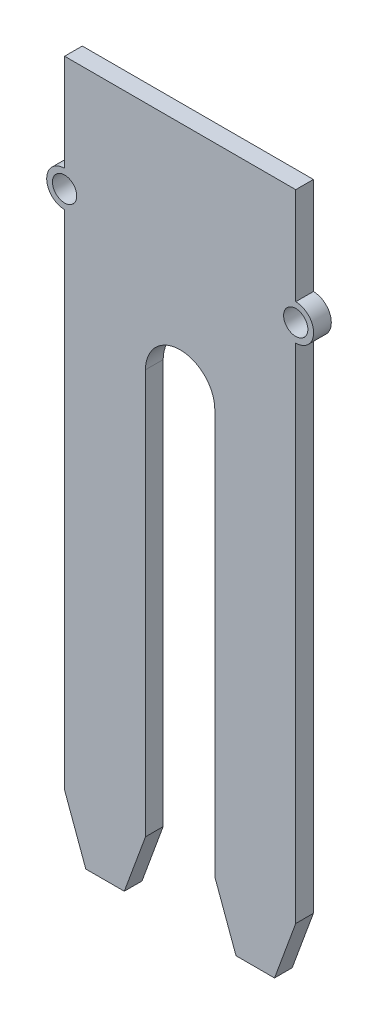
ISO-10303-21;
HEADER;
FILE_DESCRIPTION(('STEP AP214'),'2;1');
FILE_NAME('part.step','',(''),(''),'','','');
FILE_SCHEMA(('AUTOMOTIVE_DESIGN { 1 0 10303 214 1 1 1 1 }'));
ENDSEC;
DATA;
#1=APPLICATION_CONTEXT('core data for automotive mechanical design processes');
#2=APPLICATION_PROTOCOL_DEFINITION('international standard','automotive_design',2000,#1);
#3=PRODUCT_CONTEXT('',#1,'mechanical');
#4=PRODUCT('Part','Part','',(#3));
#5=PRODUCT_RELATED_PRODUCT_CATEGORY('part','',(#4));
#6=PRODUCT_DEFINITION_FORMATION('','',#4);
#7=PRODUCT_DEFINITION_CONTEXT('part definition',#1,'design');
#8=PRODUCT_DEFINITION('design','',#6,#7);
#9=PRODUCT_DEFINITION_SHAPE('','',#8);
#10=(LENGTH_UNIT() NAMED_UNIT(*) SI_UNIT(.MILLI.,.METRE.));
#11=(NAMED_UNIT(*) PLANE_ANGLE_UNIT() SI_UNIT($,.RADIAN.));
#12=(NAMED_UNIT(*) SI_UNIT($,.STERADIAN.) SOLID_ANGLE_UNIT());
#13=UNCERTAINTY_MEASURE_WITH_UNIT(LENGTH_MEASURE(1.E-05),#10,'distance_accuracy_value','');
#14=(GEOMETRIC_REPRESENTATION_CONTEXT(3) GLOBAL_UNCERTAINTY_ASSIGNED_CONTEXT((#13)) GLOBAL_UNIT_ASSIGNED_CONTEXT((#10,
#11,#12)) REPRESENTATION_CONTEXT('',''));
#15=CARTESIAN_POINT('',(0.,0.,0.));
#16=DIRECTION('',(0.,0.,1.));
#17=DIRECTION('',(1.,0.,0.));
#18=AXIS2_PLACEMENT_3D('',#15,#16,#17);
#19=CARTESIAN_POINT('',(7.20601592924715,40.,1.53));
#20=DIRECTION('',(0.,0.,-1.));
#21=DIRECTION('',(-1.,0.,0.));
#22=AXIS2_PLACEMENT_3D('',#19,#20,#21);
#23=PLANE('',#22);
#24=CARTESIAN_POINT('',(17.2060159292471,50.05,1.53));
#25=DIRECTION('',(0.,0.,1.));
#26=DIRECTION('',(1.,0.,0.));
#27=AXIS2_PLACEMENT_3D('',#24,#25,#26);
#28=CIRCLE('',#27,1.05);
#29=CARTESIAN_POINT('',(18.2560159292471,50.05,1.53));
#30=VERTEX_POINT('',#29);
#31=EDGE_CURVE('E182',#30,#30,#28,.T.);
#32=ORIENTED_EDGE('',*,*,#31,.F.);
#33=EDGE_LOOP('',(#32));
#34=FACE_BOUND('',#33,.T.);
#35=DIRECTION('',(0.344530474203145,-0.938775134068514,0.));
#36=VECTOR('',#35,1.);
#37=CARTESIAN_POINT('',(12.0410159292471,0.,1.53));
#38=LINE('',#37,#36);
#39=CARTESIAN_POINT('',(10.2060159292471,4.99999999999999,1.53));
#40=VERTEX_POINT('',#39);
#41=CARTESIAN_POINT('',(12.0410159292471,0.,1.53));
#42=VERTEX_POINT('',#41);
#43=EDGE_CURVE('E210',#40,#42,#38,.T.);
#44=ORIENTED_EDGE('',*,*,#43,.T.);
#45=DIRECTION('',(1.,0.,0.));
#46=VECTOR('',#45,1.);
#47=CARTESIAN_POINT('',(13.7060159292471,0.,1.53));
#48=LINE('',#47,#46);
#49=CARTESIAN_POINT('',(15.3710159292471,0.,1.53));
#50=VERTEX_POINT('',#49);
#51=EDGE_CURVE('E117',#42,#50,#48,.T.);
#52=ORIENTED_EDGE('',*,*,#51,.T.);
#53=DIRECTION('',(0.344530474203144,0.938775134068514,0.));
#54=VECTOR('',#53,1.);
#55=CARTESIAN_POINT('',(15.3710159292471,0.,1.53));
#56=LINE('',#55,#54);
#57=CARTESIAN_POINT('',(17.2060159292471,5.,1.53));
#58=VERTEX_POINT('',#57);
#59=EDGE_CURVE('E249',#50,#58,#56,.T.);
#60=ORIENTED_EDGE('',*,*,#59,.T.);
#61=DIRECTION('',(0.,1.,0.));
#62=VECTOR('',#61,1.);
#63=CARTESIAN_POINT('',(17.2060159292471,5.,1.53));
#64=LINE('',#63,#62);
#65=CARTESIAN_POINT('',(17.2060159292471,48.5,1.53));
#66=VERTEX_POINT('',#65);
#67=EDGE_CURVE('E268',#58,#66,#64,.T.);
#68=ORIENTED_EDGE('',*,*,#67,.T.);
#69=CARTESIAN_POINT('',(17.2060159292471,50.05,1.53));
#70=DIRECTION('',(0.,0.,1.));
#71=DIRECTION('',(1.,0.,0.));
#72=AXIS2_PLACEMENT_3D('',#69,#70,#71);
#73=CIRCLE('',#72,1.55);
#74=CARTESIAN_POINT('',(17.2060159292471,51.6,1.53));
#75=VERTEX_POINT('',#74);
#76=EDGE_CURVE('E265',#66,#75,#73,.T.);
#77=ORIENTED_EDGE('',*,*,#76,.T.);
#78=DIRECTION('',(0.,1.,0.));
#79=VECTOR('',#78,1.);
#80=CARTESIAN_POINT('',(17.2060159292471,51.6,1.53));
#81=LINE('',#80,#79);
#82=CARTESIAN_POINT('',(17.2060159292471,60.,1.53));
#83=VERTEX_POINT('',#82);
#84=EDGE_CURVE('E267',#75,#83,#81,.T.);
#85=ORIENTED_EDGE('',*,*,#84,.T.);
#86=DIRECTION('',(-1.,0.,0.));
#87=VECTOR('',#86,1.);
#88=CARTESIAN_POINT('',(-2.79398407075285,60.,1.53));
#89=LINE('',#88,#87);
#90=CARTESIAN_POINT('',(-2.79398407075285,60.,1.53));
#91=VERTEX_POINT('',#90);
#92=EDGE_CURVE('E270',#83,#91,#89,.T.);
#93=ORIENTED_EDGE('',*,*,#92,.T.);
#94=DIRECTION('',(0.,-1.,0.));
#95=VECTOR('',#94,1.);
#96=CARTESIAN_POINT('',(-2.79398407075285,51.6,1.53));
#97=LINE('',#96,#95);
#98=CARTESIAN_POINT('',(-2.79398407075285,51.6,1.53));
#99=VERTEX_POINT('',#98);
#100=EDGE_CURVE('E276',#91,#99,#97,.T.);
#101=ORIENTED_EDGE('',*,*,#100,.T.);
#102=CARTESIAN_POINT('',(-2.79398407075285,50.05,1.53));
#103=DIRECTION('',(0.,0.,1.));
#104=DIRECTION('',(1.,0.,0.));
#105=AXIS2_PLACEMENT_3D('',#102,#103,#104);
#106=CIRCLE('',#105,1.55);
#107=CARTESIAN_POINT('',(-2.79398407075285,48.5,1.53));
#108=VERTEX_POINT('',#107);
#109=EDGE_CURVE('E278',#99,#108,#106,.T.);
#110=ORIENTED_EDGE('',*,*,#109,.T.);
#111=DIRECTION('',(0.,-1.,0.));
#112=VECTOR('',#111,1.);
#113=CARTESIAN_POINT('',(-2.79398407075285,5.,1.53));
#114=LINE('',#113,#112);
#115=CARTESIAN_POINT('',(-2.79398407075285,5.,1.53));
#116=VERTEX_POINT('',#115);
#117=EDGE_CURVE('E280',#108,#116,#114,.T.);
#118=ORIENTED_EDGE('',*,*,#117,.T.);
#119=DIRECTION('',(0.344530474203145,-0.938775134068514,0.));
#120=VECTOR('',#119,1.);
#121=CARTESIAN_POINT('',(-0.958984070752854,0.,1.53));
#122=LINE('',#121,#120);
#123=CARTESIAN_POINT('',(-0.958984070752854,0.,1.53));
#124=VERTEX_POINT('',#123);
#125=EDGE_CURVE('E282',#116,#124,#122,.T.);
#126=ORIENTED_EDGE('',*,*,#125,.T.);
#127=DIRECTION('',(1.,0.,0.));
#128=VECTOR('',#127,1.);
#129=CARTESIAN_POINT('',(0.706015929247144,0.,1.53));
#130=LINE('',#129,#128);
#131=CARTESIAN_POINT('',(2.37101592924715,0.,1.53));
#132=VERTEX_POINT('',#131);
#133=EDGE_CURVE('E284',#124,#132,#130,.T.);
#134=ORIENTED_EDGE('',*,*,#133,.T.);
#135=DIRECTION('',(0.344530474203145,0.938775134068514,0.));
#136=VECTOR('',#135,1.);
#137=CARTESIAN_POINT('',(2.37101592924715,0.,1.53));
#138=LINE('',#137,#136);
#139=CARTESIAN_POINT('',(4.20601592924714,5.,1.53));
#140=VERTEX_POINT('',#139);
#141=EDGE_CURVE('E160',#132,#140,#138,.T.);
#142=ORIENTED_EDGE('',*,*,#141,.T.);
#143=DIRECTION('',(0.,1.,0.));
#144=VECTOR('',#143,1.);
#145=CARTESIAN_POINT('',(4.20601592924714,5.,1.53));
#146=LINE('',#145,#144);
#147=CARTESIAN_POINT('',(4.20601592924714,40.,1.53));
#148=VERTEX_POINT('',#147);
#149=EDGE_CURVE('E154',#140,#148,#146,.T.);
#150=ORIENTED_EDGE('',*,*,#149,.T.);
#151=CARTESIAN_POINT('',(7.20601592924715,40.,1.53));
#152=DIRECTION('',(0.,0.,-1.));
#153=DIRECTION('',(-1.,0.,0.));
#154=AXIS2_PLACEMENT_3D('',#151,#152,#153);
#155=CIRCLE('',#154,3.);
#156=CARTESIAN_POINT('',(10.2060159292471,40.,1.53));
#157=VERTEX_POINT('',#156);
#158=EDGE_CURVE('E158',#148,#157,#155,.T.);
#159=ORIENTED_EDGE('',*,*,#158,.T.);
#160=DIRECTION('',(0.,-1.,0.));
#161=VECTOR('',#160,1.);
#162=CARTESIAN_POINT('',(10.2060159292471,4.99999999999999,1.53));
#163=LINE('',#162,#161);
#164=EDGE_CURVE('E50',#157,#40,#163,.T.);
#165=ORIENTED_EDGE('',*,*,#164,.T.);
#166=EDGE_LOOP('',(#44,#52,#60,#68,#77,#85,#93,#101,#110,#118,#126,#134,#142,#150,#159,#165));
#167=FACE_BOUND('',#166,.T.);
#168=CARTESIAN_POINT('',(-2.79398407075285,50.05,1.53));
#169=DIRECTION('',(0.,0.,1.));
#170=DIRECTION('',(1.,0.,0.));
#171=AXIS2_PLACEMENT_3D('',#168,#169,#170);
#172=CIRCLE('',#171,1.05);
#173=CARTESIAN_POINT('',(-1.74398407075285,50.05,1.53));
#174=VERTEX_POINT('',#173);
#175=EDGE_CURVE('E326',#174,#174,#172,.T.);
#176=ORIENTED_EDGE('',*,*,#175,.F.);
#177=EDGE_LOOP('',(#176));
#178=FACE_BOUND('',#177,.T.);
#179=ADVANCED_FACE('F33',(#34,#167,#178),#23,.F.);
#180=CARTESIAN_POINT('',(7.20601592924715,40.,0.));
#181=DIRECTION('',(0.,0.,-1.));
#182=DIRECTION('',(-1.,0.,0.));
#183=AXIS2_PLACEMENT_3D('',#180,#181,#182);
#184=PLANE('',#183);
#185=CARTESIAN_POINT('',(17.2060159292471,50.05,0.));
#186=DIRECTION('',(0.,0.,1.));
#187=DIRECTION('',(1.,0.,0.));
#188=AXIS2_PLACEMENT_3D('',#185,#186,#187);
#189=CIRCLE('',#188,1.05);
#190=CARTESIAN_POINT('',(18.2560159292471,50.05,0.));
#191=VERTEX_POINT('',#190);
#192=EDGE_CURVE('E331',#191,#191,#189,.T.);
#193=ORIENTED_EDGE('',*,*,#192,.T.);
#194=EDGE_LOOP('',(#193));
#195=FACE_BOUND('',#194,.T.);
#196=DIRECTION('',(0.344530474203145,-0.938775134068514,0.));
#197=VECTOR('',#196,1.);
#198=CARTESIAN_POINT('',(12.0410159292471,0.,0.));
#199=LINE('',#198,#197);
#200=CARTESIAN_POINT('',(10.2060159292471,4.99999999999999,0.));
#201=VERTEX_POINT('',#200);
#202=CARTESIAN_POINT('',(12.0410159292471,0.,0.));
#203=VERTEX_POINT('',#202);
#204=EDGE_CURVE('E178',#201,#203,#199,.T.);
#205=ORIENTED_EDGE('',*,*,#204,.F.);
#206=DIRECTION('',(0.,-1.,0.));
#207=VECTOR('',#206,1.);
#208=CARTESIAN_POINT('',(10.2060159292471,4.99999999999999,0.));
#209=LINE('',#208,#207);
#210=CARTESIAN_POINT('',(10.2060159292471,40.,0.));
#211=VERTEX_POINT('',#210);
#212=EDGE_CURVE('E109',#211,#201,#209,.T.);
#213=ORIENTED_EDGE('',*,*,#212,.F.);
#214=CARTESIAN_POINT('',(7.20601592924715,40.,0.));
#215=DIRECTION('',(0.,0.,-1.));
#216=DIRECTION('',(-1.,0.,0.));
#217=AXIS2_PLACEMENT_3D('',#214,#215,#216);
#218=CIRCLE('',#217,3.);
#219=CARTESIAN_POINT('',(4.20601592924714,40.,0.));
#220=VERTEX_POINT('',#219);
#221=EDGE_CURVE('E103',#220,#211,#218,.T.);
#222=ORIENTED_EDGE('',*,*,#221,.F.);
#223=DIRECTION('',(0.,1.,0.));
#224=VECTOR('',#223,1.);
#225=CARTESIAN_POINT('',(4.20601592924714,5.,0.));
#226=LINE('',#225,#224);
#227=CARTESIAN_POINT('',(4.20601592924714,5.,0.));
#228=VERTEX_POINT('',#227);
#229=EDGE_CURVE('E168',#228,#220,#226,.T.);
#230=ORIENTED_EDGE('',*,*,#229,.F.);
#231=DIRECTION('',(0.344530474203145,0.938775134068514,0.));
#232=VECTOR('',#231,1.);
#233=CARTESIAN_POINT('',(2.37101592924715,0.,0.));
#234=LINE('',#233,#232);
#235=CARTESIAN_POINT('',(2.37101592924715,0.,0.));
#236=VERTEX_POINT('',#235);
#237=EDGE_CURVE('E205',#236,#228,#234,.T.);
#238=ORIENTED_EDGE('',*,*,#237,.F.);
#239=DIRECTION('',(1.,0.,0.));
#240=VECTOR('',#239,1.);
#241=CARTESIAN_POINT('',(0.706015929247144,0.,0.));
#242=LINE('',#241,#240);
#243=CARTESIAN_POINT('',(-0.958984070752854,0.,0.));
#244=VERTEX_POINT('',#243);
#245=EDGE_CURVE('E203',#244,#236,#242,.T.);
#246=ORIENTED_EDGE('',*,*,#245,.F.);
#247=DIRECTION('',(0.344530474203145,-0.938775134068514,0.));
#248=VECTOR('',#247,1.);
#249=CARTESIAN_POINT('',(-0.958984070752854,0.,0.));
#250=LINE('',#249,#248);
#251=CARTESIAN_POINT('',(-2.79398407075285,5.,0.));
#252=VERTEX_POINT('',#251);
#253=EDGE_CURVE('E200',#252,#244,#250,.T.);
#254=ORIENTED_EDGE('',*,*,#253,.F.);
#255=DIRECTION('',(0.,-1.,0.));
#256=VECTOR('',#255,1.);
#257=CARTESIAN_POINT('',(-2.79398407075285,5.,0.));
#258=LINE('',#257,#256);
#259=CARTESIAN_POINT('',(-2.79398407075285,48.5,0.));
#260=VERTEX_POINT('',#259);
#261=EDGE_CURVE('E198',#260,#252,#258,.T.);
#262=ORIENTED_EDGE('',*,*,#261,.F.);
#263=CARTESIAN_POINT('',(-2.79398407075285,50.05,0.));
#264=DIRECTION('',(0.,0.,1.));
#265=DIRECTION('',(1.,0.,0.));
#266=AXIS2_PLACEMENT_3D('',#263,#264,#265);
#267=CIRCLE('',#266,1.55);
#268=CARTESIAN_POINT('',(-2.79398407075285,51.6,0.));
#269=VERTEX_POINT('',#268);
#270=EDGE_CURVE('E196',#269,#260,#267,.T.);
#271=ORIENTED_EDGE('',*,*,#270,.F.);
#272=DIRECTION('',(0.,-1.,0.));
#273=VECTOR('',#272,1.);
#274=CARTESIAN_POINT('',(-2.79398407075285,51.6,0.));
#275=LINE('',#274,#273);
#276=CARTESIAN_POINT('',(-2.79398407075285,60.,0.));
#277=VERTEX_POINT('',#276);
#278=EDGE_CURVE('E194',#277,#269,#275,.T.);
#279=ORIENTED_EDGE('',*,*,#278,.F.);
#280=DIRECTION('',(-1.,0.,0.));
#281=VECTOR('',#280,1.);
#282=CARTESIAN_POINT('',(-2.79398407075285,60.,0.));
#283=LINE('',#282,#281);
#284=CARTESIAN_POINT('',(17.2060159292471,60.,0.));
#285=VERTEX_POINT('',#284);
#286=EDGE_CURVE('E192',#285,#277,#283,.T.);
#287=ORIENTED_EDGE('',*,*,#286,.F.);
#288=DIRECTION('',(0.,1.,0.));
#289=VECTOR('',#288,1.);
#290=CARTESIAN_POINT('',(17.2060159292471,51.6,0.));
#291=LINE('',#290,#289);
#292=CARTESIAN_POINT('',(17.2060159292471,51.6,0.));
#293=VERTEX_POINT('',#292);
#294=EDGE_CURVE('E190',#293,#285,#291,.T.);
#295=ORIENTED_EDGE('',*,*,#294,.F.);
#296=CARTESIAN_POINT('',(17.2060159292471,50.05,0.));
#297=DIRECTION('',(0.,0.,1.));
#298=DIRECTION('',(1.,0.,0.));
#299=AXIS2_PLACEMENT_3D('',#296,#297,#298);
#300=CIRCLE('',#299,1.55);
#301=CARTESIAN_POINT('',(17.2060159292471,48.5,0.));
#302=VERTEX_POINT('',#301);
#303=EDGE_CURVE('E188',#302,#293,#300,.T.);
#304=ORIENTED_EDGE('',*,*,#303,.F.);
#305=DIRECTION('',(0.,1.,0.));
#306=VECTOR('',#305,1.);
#307=CARTESIAN_POINT('',(17.2060159292471,5.,0.));
#308=LINE('',#307,#306);
#309=CARTESIAN_POINT('',(17.2060159292471,5.,0.));
#310=VERTEX_POINT('',#309);
#311=EDGE_CURVE('E186',#310,#302,#308,.T.);
#312=ORIENTED_EDGE('',*,*,#311,.F.);
#313=DIRECTION('',(0.344530474203144,0.938775134068514,0.));
#314=VECTOR('',#313,1.);
#315=CARTESIAN_POINT('',(15.3710159292471,0.,0.));
#316=LINE('',#315,#314);
#317=CARTESIAN_POINT('',(15.3710159292471,0.,0.));
#318=VERTEX_POINT('',#317);
#319=EDGE_CURVE('E184',#318,#310,#316,.T.);
#320=ORIENTED_EDGE('',*,*,#319,.F.);
#321=DIRECTION('',(1.,0.,0.));
#322=VECTOR('',#321,1.);
#323=CARTESIAN_POINT('',(13.7060159292471,0.,0.));
#324=LINE('',#323,#322);
#325=EDGE_CURVE('E181',#203,#318,#324,.T.);
#326=ORIENTED_EDGE('',*,*,#325,.F.);
#327=EDGE_LOOP('',(#205,#213,#222,#230,#238,#246,#254,#262,#271,#279,#287,#295,#304,#312,#320,#326));
#328=FACE_BOUND('',#327,.T.);
#329=CARTESIAN_POINT('',(-2.79398407075285,50.05,0.));
#330=DIRECTION('',(0.,0.,1.));
#331=DIRECTION('',(1.,0.,0.));
#332=AXIS2_PLACEMENT_3D('',#329,#330,#331);
#333=CIRCLE('',#332,1.05);
#334=CARTESIAN_POINT('',(-1.74398407075285,50.05,0.));
#335=VERTEX_POINT('',#334);
#336=EDGE_CURVE('E329',#335,#335,#333,.T.);
#337=ORIENTED_EDGE('',*,*,#336,.T.);
#338=EDGE_LOOP('',(#337));
#339=FACE_BOUND('',#338,.T.);
#340=ADVANCED_FACE('F253',(#195,#328,#339),#184,.T.);
#341=CARTESIAN_POINT('',(12.0410159292471,0.,1.53));
#342=DIRECTION('',(0.938775134068514,0.344530474203145,0.));
#343=DIRECTION('',(-0.344530474203145,0.938775134068514,0.));
#344=AXIS2_PLACEMENT_3D('',#341,#342,#343);
#345=PLANE('',#344);
#346=ORIENTED_EDGE('',*,*,#204,.T.);
#347=DIRECTION('',(0.,0.,-1.));
#348=VECTOR('',#347,1.);
#349=CARTESIAN_POINT('',(12.0410159292471,0.,1.53));
#350=LINE('',#349,#348);
#351=EDGE_CURVE('E11',#42,#203,#350,.T.);
#352=ORIENTED_EDGE('',*,*,#351,.F.);
#353=ORIENTED_EDGE('',*,*,#43,.F.);
#354=DIRECTION('',(0.,0.,-1.));
#355=VECTOR('',#354,1.);
#356=CARTESIAN_POINT('',(10.2060159292471,4.99999999999999,1.53));
#357=LINE('',#356,#355);
#358=EDGE_CURVE('E174',#40,#201,#357,.T.);
#359=ORIENTED_EDGE('',*,*,#358,.T.);
#360=EDGE_LOOP('',(#346,#352,#353,#359));
#361=FACE_BOUND('',#360,.T.);
#362=ADVANCED_FACE('F35',(#361),#345,.F.);
#363=CARTESIAN_POINT('',(13.7060159292471,0.,1.53));
#364=DIRECTION('',(0.,1.,0.));
#365=DIRECTION('',(0.,0.,1.));
#366=AXIS2_PLACEMENT_3D('',#363,#364,#365);
#367=PLANE('',#366);
#368=ORIENTED_EDGE('',*,*,#325,.T.);
#369=DIRECTION('',(0.,0.,-1.));
#370=VECTOR('',#369,1.);
#371=CARTESIAN_POINT('',(15.3710159292471,0.,1.53));
#372=LINE('',#371,#370);
#373=EDGE_CURVE('E42',#50,#318,#372,.T.);
#374=ORIENTED_EDGE('',*,*,#373,.F.);
#375=ORIENTED_EDGE('',*,*,#51,.F.);
#376=ORIENTED_EDGE('',*,*,#351,.T.);
#377=EDGE_LOOP('',(#368,#374,#375,#376));
#378=FACE_BOUND('',#377,.T.);
#379=ADVANCED_FACE('F465',(#378),#367,.F.);
#380=CARTESIAN_POINT('',(15.3710159292471,0.,1.53));
#381=DIRECTION('',(-0.938775134068514,0.344530474203144,0.));
#382=DIRECTION('',(-0.344530474203144,-0.938775134068514,0.));
#383=AXIS2_PLACEMENT_3D('',#380,#381,#382);
#384=PLANE('',#383);
#385=ORIENTED_EDGE('',*,*,#319,.T.);
#386=DIRECTION('',(0.,0.,-1.));
#387=VECTOR('',#386,1.);
#388=CARTESIAN_POINT('',(17.2060159292471,5.,1.53));
#389=LINE('',#388,#387);
#390=EDGE_CURVE('E241',#58,#310,#389,.T.);
#391=ORIENTED_EDGE('',*,*,#390,.F.);
#392=ORIENTED_EDGE('',*,*,#59,.F.);
#393=ORIENTED_EDGE('',*,*,#373,.T.);
#394=EDGE_LOOP('',(#385,#391,#392,#393));
#395=FACE_BOUND('',#394,.T.);
#396=ADVANCED_FACE('F247',(#395),#384,.F.);
#397=CARTESIAN_POINT('',(17.2060159292471,5.,1.53));
#398=DIRECTION('',(-1.,0.,0.));
#399=DIRECTION('',(0.,0.,1.));
#400=AXIS2_PLACEMENT_3D('',#397,#398,#399);
#401=PLANE('',#400);
#402=ORIENTED_EDGE('',*,*,#311,.T.);
#403=DIRECTION('',(0.,0.,-1.));
#404=VECTOR('',#403,1.);
#405=CARTESIAN_POINT('',(17.2060159292471,48.5,1.53));
#406=LINE('',#405,#404);
#407=EDGE_CURVE('E238',#66,#302,#406,.T.);
#408=ORIENTED_EDGE('',*,*,#407,.F.);
#409=ORIENTED_EDGE('',*,*,#67,.F.);
#410=ORIENTED_EDGE('',*,*,#390,.T.);
#411=EDGE_LOOP('',(#402,#408,#409,#410));
#412=FACE_BOUND('',#411,.T.);
#413=ADVANCED_FACE('F259',(#412),#401,.F.);
#414=CARTESIAN_POINT('',(17.2060159292471,50.05,1.53));
#415=DIRECTION('',(0.,0.,-1.));
#416=DIRECTION('',(-1.,0.,0.));
#417=AXIS2_PLACEMENT_3D('',#414,#415,#416);
#418=CYLINDRICAL_SURFACE('',#417,1.55);
#419=ORIENTED_EDGE('',*,*,#303,.T.);
#420=DIRECTION('',(0.,0.,-1.));
#421=VECTOR('',#420,1.);
#422=CARTESIAN_POINT('',(17.2060159292471,51.6,1.53));
#423=LINE('',#422,#421);
#424=EDGE_CURVE('E235',#75,#293,#423,.T.);
#425=ORIENTED_EDGE('',*,*,#424,.F.);
#426=ORIENTED_EDGE('',*,*,#76,.F.);
#427=ORIENTED_EDGE('',*,*,#407,.T.);
#428=EDGE_LOOP('',(#419,#425,#426,#427));
#429=FACE_BOUND('',#428,.T.);
#430=ADVANCED_FACE('F263',(#429),#418,.T.);
#431=CARTESIAN_POINT('',(17.2060159292471,51.6,1.53));
#432=DIRECTION('',(-1.,0.,0.));
#433=DIRECTION('',(0.,0.,1.));
#434=AXIS2_PLACEMENT_3D('',#431,#432,#433);
#435=PLANE('',#434);
#436=ORIENTED_EDGE('',*,*,#294,.T.);
#437=DIRECTION('',(0.,0.,-1.));
#438=VECTOR('',#437,1.);
#439=CARTESIAN_POINT('',(17.2060159292471,60.,1.53));
#440=LINE('',#439,#438);
#441=EDGE_CURVE('E232',#83,#285,#440,.T.);
#442=ORIENTED_EDGE('',*,*,#441,.F.);
#443=ORIENTED_EDGE('',*,*,#84,.F.);
#444=ORIENTED_EDGE('',*,*,#424,.T.);
#445=EDGE_LOOP('',(#436,#442,#443,#444));
#446=FACE_BOUND('',#445,.T.);
#447=ADVANCED_FACE('F430',(#446),#435,.F.);
#448=CARTESIAN_POINT('',(-2.79398407075285,60.,1.53));
#449=DIRECTION('',(0.,-1.,0.));
#450=DIRECTION('',(1.,0.,0.));
#451=AXIS2_PLACEMENT_3D('',#448,#449,#450);
#452=PLANE('',#451);
#453=ORIENTED_EDGE('',*,*,#286,.T.);
#454=DIRECTION('',(0.,0.,-1.));
#455=VECTOR('',#454,1.);
#456=CARTESIAN_POINT('',(-2.79398407075285,60.,1.53));
#457=LINE('',#456,#455);
#458=EDGE_CURVE('E229',#91,#277,#457,.T.);
#459=ORIENTED_EDGE('',*,*,#458,.F.);
#460=ORIENTED_EDGE('',*,*,#92,.F.);
#461=ORIENTED_EDGE('',*,*,#441,.T.);
#462=EDGE_LOOP('',(#453,#459,#460,#461));
#463=FACE_BOUND('',#462,.T.);
#464=ADVANCED_FACE('F420',(#463),#452,.F.);
#465=CARTESIAN_POINT('',(-2.79398407075285,51.6,1.53));
#466=DIRECTION('',(1.,0.,0.));
#467=DIRECTION('',(0.,0.,-1.));
#468=AXIS2_PLACEMENT_3D('',#465,#466,#467);
#469=PLANE('',#468);
#470=ORIENTED_EDGE('',*,*,#278,.T.);
#471=DIRECTION('',(0.,0.,-1.));
#472=VECTOR('',#471,1.);
#473=CARTESIAN_POINT('',(-2.79398407075285,51.6,1.53));
#474=LINE('',#473,#472);
#475=EDGE_CURVE('E226',#99,#269,#474,.T.);
#476=ORIENTED_EDGE('',*,*,#475,.F.);
#477=ORIENTED_EDGE('',*,*,#100,.F.);
#478=ORIENTED_EDGE('',*,*,#458,.T.);
#479=EDGE_LOOP('',(#470,#476,#477,#478));
#480=FACE_BOUND('',#479,.T.);
#481=ADVANCED_FACE('F410',(#480),#469,.F.);
#482=CARTESIAN_POINT('',(-2.79398407075285,50.05,1.53));
#483=DIRECTION('',(0.,0.,-1.));
#484=DIRECTION('',(-1.,0.,0.));
#485=AXIS2_PLACEMENT_3D('',#482,#483,#484);
#486=CYLINDRICAL_SURFACE('',#485,1.55);
#487=ORIENTED_EDGE('',*,*,#270,.T.);
#488=DIRECTION('',(0.,0.,-1.));
#489=VECTOR('',#488,1.);
#490=CARTESIAN_POINT('',(-2.79398407075285,48.5,1.53));
#491=LINE('',#490,#489);
#492=EDGE_CURVE('E223',#108,#260,#491,.T.);
#493=ORIENTED_EDGE('',*,*,#492,.F.);
#494=ORIENTED_EDGE('',*,*,#109,.F.);
#495=ORIENTED_EDGE('',*,*,#475,.T.);
#496=EDGE_LOOP('',(#487,#493,#494,#495));
#497=FACE_BOUND('',#496,.T.);
#498=ADVANCED_FACE('F400',(#497),#486,.T.);
#499=CARTESIAN_POINT('',(-2.79398407075285,5.,1.53));
#500=DIRECTION('',(1.,0.,0.));
#501=DIRECTION('',(0.,0.,-1.));
#502=AXIS2_PLACEMENT_3D('',#499,#500,#501);
#503=PLANE('',#502);
#504=ORIENTED_EDGE('',*,*,#261,.T.);
#505=DIRECTION('',(0.,0.,-1.));
#506=VECTOR('',#505,1.);
#507=CARTESIAN_POINT('',(-2.79398407075285,5.,1.53));
#508=LINE('',#507,#506);
#509=EDGE_CURVE('E220',#116,#252,#508,.T.);
#510=ORIENTED_EDGE('',*,*,#509,.F.);
#511=ORIENTED_EDGE('',*,*,#117,.F.);
#512=ORIENTED_EDGE('',*,*,#492,.T.);
#513=EDGE_LOOP('',(#504,#510,#511,#512));
#514=FACE_BOUND('',#513,.T.);
#515=ADVANCED_FACE('F390',(#514),#503,.F.);
#516=CARTESIAN_POINT('',(-0.958984070752854,0.,1.53));
#517=DIRECTION('',(0.938775134068514,0.344530474203145,0.));
#518=DIRECTION('',(-0.344530474203145,0.938775134068514,0.));
#519=AXIS2_PLACEMENT_3D('',#516,#517,#518);
#520=PLANE('',#519);
#521=ORIENTED_EDGE('',*,*,#253,.T.);
#522=DIRECTION('',(0.,0.,-1.));
#523=VECTOR('',#522,1.);
#524=CARTESIAN_POINT('',(-0.958984070752854,0.,1.53));
#525=LINE('',#524,#523);
#526=EDGE_CURVE('E217',#124,#244,#525,.T.);
#527=ORIENTED_EDGE('',*,*,#526,.F.);
#528=ORIENTED_EDGE('',*,*,#125,.F.);
#529=ORIENTED_EDGE('',*,*,#509,.T.);
#530=EDGE_LOOP('',(#521,#527,#528,#529));
#531=FACE_BOUND('',#530,.T.);
#532=ADVANCED_FACE('F380',(#531),#520,.F.);
#533=CARTESIAN_POINT('',(0.706015929247144,0.,1.53));
#534=DIRECTION('',(0.,1.,0.));
#535=DIRECTION('',(0.,0.,1.));
#536=AXIS2_PLACEMENT_3D('',#533,#534,#535);
#537=PLANE('',#536);
#538=ORIENTED_EDGE('',*,*,#245,.T.);
#539=DIRECTION('',(0.,0.,-1.));
#540=VECTOR('',#539,1.);
#541=CARTESIAN_POINT('',(2.37101592924715,0.,1.53));
#542=LINE('',#541,#540);
#543=EDGE_CURVE('E214',#132,#236,#542,.T.);
#544=ORIENTED_EDGE('',*,*,#543,.F.);
#545=ORIENTED_EDGE('',*,*,#133,.F.);
#546=ORIENTED_EDGE('',*,*,#526,.T.);
#547=EDGE_LOOP('',(#538,#544,#545,#546));
#548=FACE_BOUND('',#547,.T.);
#549=ADVANCED_FACE('F290',(#548),#537,.F.);
#550=CARTESIAN_POINT('',(2.37101592924715,0.,1.53));
#551=DIRECTION('',(-0.938775134068514,0.344530474203145,0.));
#552=DIRECTION('',(-0.344530474203145,-0.938775134068514,0.));
#553=AXIS2_PLACEMENT_3D('',#550,#551,#552);
#554=PLANE('',#553);
#555=ORIENTED_EDGE('',*,*,#237,.T.);
#556=DIRECTION('',(0.,0.,-1.));
#557=VECTOR('',#556,1.);
#558=CARTESIAN_POINT('',(4.20601592924714,5.,1.53));
#559=LINE('',#558,#557);
#560=EDGE_CURVE('E169',#140,#228,#559,.T.);
#561=ORIENTED_EDGE('',*,*,#560,.F.);
#562=ORIENTED_EDGE('',*,*,#141,.F.);
#563=ORIENTED_EDGE('',*,*,#543,.T.);
#564=EDGE_LOOP('',(#555,#561,#562,#563));
#565=FACE_BOUND('',#564,.T.);
#566=ADVANCED_FACE('F293',(#565),#554,.F.);
#567=CARTESIAN_POINT('',(4.20601592924714,5.,1.53));
#568=DIRECTION('',(-1.,0.,0.));
#569=DIRECTION('',(0.,0.,1.));
#570=AXIS2_PLACEMENT_3D('',#567,#568,#569);
#571=PLANE('',#570);
#572=ORIENTED_EDGE('',*,*,#229,.T.);
#573=DIRECTION('',(0.,0.,-1.));
#574=VECTOR('',#573,1.);
#575=CARTESIAN_POINT('',(4.20601592924714,40.,1.53));
#576=LINE('',#575,#574);
#577=EDGE_CURVE('E165',#148,#220,#576,.T.);
#578=ORIENTED_EDGE('',*,*,#577,.F.);
#579=ORIENTED_EDGE('',*,*,#149,.F.);
#580=ORIENTED_EDGE('',*,*,#560,.T.);
#581=EDGE_LOOP('',(#572,#578,#579,#580));
#582=FACE_BOUND('',#581,.T.);
#583=ADVANCED_FACE('F166',(#582),#571,.F.);
#584=CARTESIAN_POINT('',(7.20601592924715,40.,1.53));
#585=DIRECTION('',(0.,0.,-1.));
#586=DIRECTION('',(-1.,0.,0.));
#587=AXIS2_PLACEMENT_3D('',#584,#585,#586);
#588=CYLINDRICAL_SURFACE('',#587,3.);
#589=ORIENTED_EDGE('',*,*,#221,.T.);
#590=DIRECTION('',(0.,0.,-1.));
#591=VECTOR('',#590,1.);
#592=CARTESIAN_POINT('',(10.2060159292471,40.,1.53));
#593=LINE('',#592,#591);
#594=EDGE_CURVE('E170',#157,#211,#593,.T.);
#595=ORIENTED_EDGE('',*,*,#594,.F.);
#596=ORIENTED_EDGE('',*,*,#158,.F.);
#597=ORIENTED_EDGE('',*,*,#577,.T.);
#598=EDGE_LOOP('',(#589,#595,#596,#597));
#599=FACE_BOUND('',#598,.T.);
#600=ADVANCED_FACE('F172',(#599),#588,.F.);
#601=CARTESIAN_POINT('',(10.2060159292471,4.99999999999999,1.53));
#602=DIRECTION('',(1.,0.,0.));
#603=DIRECTION('',(0.,0.,-1.));
#604=AXIS2_PLACEMENT_3D('',#601,#602,#603);
#605=PLANE('',#604);
#606=ORIENTED_EDGE('',*,*,#212,.T.);
#607=ORIENTED_EDGE('',*,*,#358,.F.);
#608=ORIENTED_EDGE('',*,*,#164,.F.);
#609=ORIENTED_EDGE('',*,*,#594,.T.);
#610=EDGE_LOOP('',(#606,#607,#608,#609));
#611=FACE_BOUND('',#610,.T.);
#612=ADVANCED_FACE('F297',(#611),#605,.F.);
#613=CARTESIAN_POINT('',(17.2060159292471,50.05,1.53));
#614=DIRECTION('',(0.,0.,-1.));
#615=DIRECTION('',(-1.,0.,0.));
#616=AXIS2_PLACEMENT_3D('',#613,#614,#615);
#617=CYLINDRICAL_SURFACE('',#616,1.05);
#618=ORIENTED_EDGE('',*,*,#31,.T.);
#619=EDGE_LOOP('',(#618));
#620=FACE_BOUND('',#619,.T.);
#621=ORIENTED_EDGE('',*,*,#192,.F.);
#622=EDGE_LOOP('',(#621));
#623=FACE_BOUND('',#622,.T.);
#624=ADVANCED_FACE('F299',(#620,#623),#617,.F.);
#625=CARTESIAN_POINT('',(-2.79398407075285,50.05,1.53));
#626=DIRECTION('',(0.,0.,-1.));
#627=DIRECTION('',(-1.,0.,0.));
#628=AXIS2_PLACEMENT_3D('',#625,#626,#627);
#629=CYLINDRICAL_SURFACE('',#628,1.05);
#630=ORIENTED_EDGE('',*,*,#175,.T.);
#631=EDGE_LOOP('',(#630));
#632=FACE_BOUND('',#631,.T.);
#633=ORIENTED_EDGE('',*,*,#336,.F.);
#634=EDGE_LOOP('',(#633));
#635=FACE_BOUND('',#634,.T.);
#636=ADVANCED_FACE('F305',(#632,#635),#629,.F.);
#637=CLOSED_SHELL('',(#179,#340,#362,#379,#396,#413,#430,#447,#464,#481,#498,#515,#532,#549,
#566,#583,#600,#612,#624,#636));
#638=MANIFOLD_SOLID_BREP('B2',#637);
#639=ADVANCED_BREP_SHAPE_REPRESENTATION('',(#18,#638),#14);
#640=SHAPE_DEFINITION_REPRESENTATION(#9,#639);
ENDSEC;
END-ISO-10303-21;
